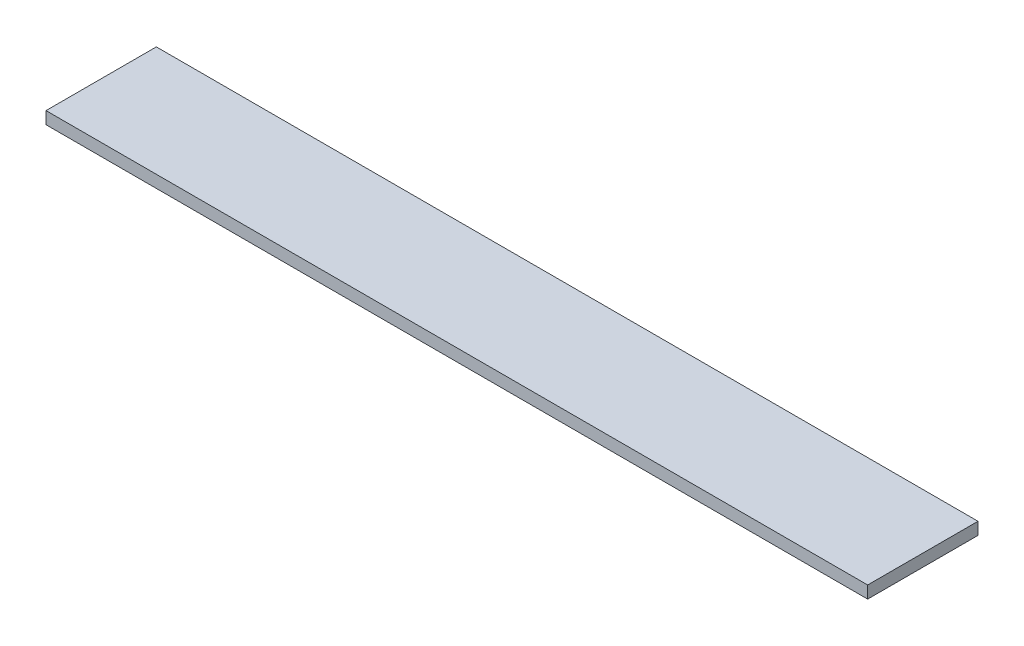
ISO-10303-21;
HEADER;
FILE_DESCRIPTION(('STEP AP214'),'2;1');
FILE_NAME('part.step','',(''),(''),'','','');
FILE_SCHEMA(('AUTOMOTIVE_DESIGN { 1 0 10303 214 1 1 1 1 }'));
ENDSEC;
DATA;
#1=APPLICATION_CONTEXT('core data for automotive mechanical design processes');
#2=APPLICATION_PROTOCOL_DEFINITION('international standard','automotive_design',2000,#1);
#3=PRODUCT_CONTEXT('',#1,'mechanical');
#4=PRODUCT('Part','Part','',(#3));
#5=PRODUCT_RELATED_PRODUCT_CATEGORY('part','',(#4));
#6=PRODUCT_DEFINITION_FORMATION('','',#4);
#7=PRODUCT_DEFINITION_CONTEXT('part definition',#1,'design');
#8=PRODUCT_DEFINITION('design','',#6,#7);
#9=PRODUCT_DEFINITION_SHAPE('','',#8);
#10=(LENGTH_UNIT() NAMED_UNIT(*) SI_UNIT(.MILLI.,.METRE.));
#11=(NAMED_UNIT(*) PLANE_ANGLE_UNIT() SI_UNIT($,.RADIAN.));
#12=(NAMED_UNIT(*) SI_UNIT($,.STERADIAN.) SOLID_ANGLE_UNIT());
#13=UNCERTAINTY_MEASURE_WITH_UNIT(LENGTH_MEASURE(1.E-05),#10,'distance_accuracy_value','');
#14=(GEOMETRIC_REPRESENTATION_CONTEXT(3) GLOBAL_UNCERTAINTY_ASSIGNED_CONTEXT((#13)) GLOBAL_UNIT_ASSIGNED_CONTEXT((#10,
#11,#12)) REPRESENTATION_CONTEXT('',''));
#15=CARTESIAN_POINT('',(0.,0.,0.));
#16=DIRECTION('',(0.,0.,1.));
#17=DIRECTION('',(1.,0.,0.));
#18=AXIS2_PLACEMENT_3D('',#15,#16,#17);
#19=CARTESIAN_POINT('',(100.53,-3.,-13.5));
#20=DIRECTION('',(1.,0.,0.));
#21=DIRECTION('',(0.,0.,-1.));
#22=AXIS2_PLACEMENT_3D('',#19,#20,#21);
#23=PLANE('',#22);
#24=DIRECTION('',(0.,0.,-1.));
#25=VECTOR('',#24,1.);
#26=CARTESIAN_POINT('',(100.53,0.,-13.5));
#27=LINE('',#26,#25);
#28=CARTESIAN_POINT('',(100.53,0.,13.5));
#29=VERTEX_POINT('',#28);
#30=CARTESIAN_POINT('',(100.53,0.,-13.5));
#31=VERTEX_POINT('',#30);
#32=EDGE_CURVE('E97',#29,#31,#27,.T.);
#33=ORIENTED_EDGE('',*,*,#32,.F.);
#34=DIRECTION('',(0.,1.,0.));
#35=VECTOR('',#34,1.);
#36=CARTESIAN_POINT('',(100.53,-3.,13.5));
#37=LINE('',#36,#35);
#38=CARTESIAN_POINT('',(100.53,-3.,13.5));
#39=VERTEX_POINT('',#38);
#40=EDGE_CURVE('E11',#39,#29,#37,.T.);
#41=ORIENTED_EDGE('',*,*,#40,.F.);
#42=DIRECTION('',(0.,0.,-1.));
#43=VECTOR('',#42,1.);
#44=CARTESIAN_POINT('',(100.53,-3.,-13.5));
#45=LINE('',#44,#43);
#46=CARTESIAN_POINT('',(100.53,-3.,-13.5));
#47=VERTEX_POINT('',#46);
#48=EDGE_CURVE('E91',#39,#47,#45,.T.);
#49=ORIENTED_EDGE('',*,*,#48,.T.);
#50=DIRECTION('',(0.,1.,0.));
#51=VECTOR('',#50,1.);
#52=CARTESIAN_POINT('',(100.53,-3.,-13.5));
#53=LINE('',#52,#51);
#54=EDGE_CURVE('E36',#47,#31,#53,.T.);
#55=ORIENTED_EDGE('',*,*,#54,.T.);
#56=EDGE_LOOP('',(#33,#41,#49,#55));
#57=FACE_BOUND('',#56,.T.);
#58=ADVANCED_FACE('F33',(#57),#23,.T.);
#59=CARTESIAN_POINT('',(-100.53,-3.,13.5));
#60=DIRECTION('',(0.,0.,1.));
#61=DIRECTION('',(1.,0.,0.));
#62=AXIS2_PLACEMENT_3D('',#59,#60,#61);
#63=PLANE('',#62);
#64=DIRECTION('',(1.,0.,0.));
#65=VECTOR('',#64,1.);
#66=CARTESIAN_POINT('',(-100.53,0.,13.5));
#67=LINE('',#66,#65);
#68=CARTESIAN_POINT('',(-100.53,0.,13.5));
#69=VERTEX_POINT('',#68);
#70=EDGE_CURVE('E93',#69,#29,#67,.T.);
#71=ORIENTED_EDGE('',*,*,#70,.F.);
#72=DIRECTION('',(0.,1.,0.));
#73=VECTOR('',#72,1.);
#74=CARTESIAN_POINT('',(-100.53,-3.,13.5));
#75=LINE('',#74,#73);
#76=CARTESIAN_POINT('',(-100.53,-3.,13.5));
#77=VERTEX_POINT('',#76);
#78=EDGE_CURVE('E42',#77,#69,#75,.T.);
#79=ORIENTED_EDGE('',*,*,#78,.F.);
#80=DIRECTION('',(1.,0.,0.));
#81=VECTOR('',#80,1.);
#82=CARTESIAN_POINT('',(-100.53,-3.,13.5));
#83=LINE('',#82,#81);
#84=EDGE_CURVE('E88',#77,#39,#83,.T.);
#85=ORIENTED_EDGE('',*,*,#84,.T.);
#86=ORIENTED_EDGE('',*,*,#40,.T.);
#87=EDGE_LOOP('',(#71,#79,#85,#86));
#88=FACE_BOUND('',#87,.T.);
#89=ADVANCED_FACE('F107',(#88),#63,.T.);
#90=CARTESIAN_POINT('',(-100.53,-3.,-13.5));
#91=DIRECTION('',(-1.,0.,0.));
#92=DIRECTION('',(0.,0.,1.));
#93=AXIS2_PLACEMENT_3D('',#90,#91,#92);
#94=PLANE('',#93);
#95=DIRECTION('',(0.,0.,1.));
#96=VECTOR('',#95,1.);
#97=CARTESIAN_POINT('',(-100.53,0.,-13.5));
#98=LINE('',#97,#96);
#99=CARTESIAN_POINT('',(-100.53,0.,-13.5));
#100=VERTEX_POINT('',#99);
#101=EDGE_CURVE('E83',#100,#69,#98,.T.);
#102=ORIENTED_EDGE('',*,*,#101,.F.);
#103=DIRECTION('',(0.,1.,0.));
#104=VECTOR('',#103,1.);
#105=CARTESIAN_POINT('',(-100.53,-3.,-13.5));
#106=LINE('',#105,#104);
#107=CARTESIAN_POINT('',(-100.53,-3.,-13.5));
#108=VERTEX_POINT('',#107);
#109=EDGE_CURVE('E78',#108,#100,#106,.T.);
#110=ORIENTED_EDGE('',*,*,#109,.F.);
#111=DIRECTION('',(0.,0.,1.));
#112=VECTOR('',#111,1.);
#113=CARTESIAN_POINT('',(-100.53,-3.,-13.5));
#114=LINE('',#113,#112);
#115=EDGE_CURVE('E81',#108,#77,#114,.T.);
#116=ORIENTED_EDGE('',*,*,#115,.T.);
#117=ORIENTED_EDGE('',*,*,#78,.T.);
#118=EDGE_LOOP('',(#102,#110,#116,#117));
#119=FACE_BOUND('',#118,.T.);
#120=ADVANCED_FACE('F80',(#119),#94,.T.);
#121=CARTESIAN_POINT('',(-100.53,-3.,-13.5));
#122=DIRECTION('',(0.,0.,-1.));
#123=DIRECTION('',(-1.,0.,0.));
#124=AXIS2_PLACEMENT_3D('',#121,#122,#123);
#125=PLANE('',#124);
#126=DIRECTION('',(-1.,0.,0.));
#127=VECTOR('',#126,1.);
#128=CARTESIAN_POINT('',(-100.53,0.,-13.5));
#129=LINE('',#128,#127);
#130=EDGE_CURVE('E100',#31,#100,#129,.T.);
#131=ORIENTED_EDGE('',*,*,#130,.F.);
#132=ORIENTED_EDGE('',*,*,#54,.F.);
#133=DIRECTION('',(-1.,0.,0.));
#134=VECTOR('',#133,1.);
#135=CARTESIAN_POINT('',(-100.53,-3.,-13.5));
#136=LINE('',#135,#134);
#137=EDGE_CURVE('E87',#47,#108,#136,.T.);
#138=ORIENTED_EDGE('',*,*,#137,.T.);
#139=ORIENTED_EDGE('',*,*,#109,.T.);
#140=EDGE_LOOP('',(#131,#132,#138,#139));
#141=FACE_BOUND('',#140,.T.);
#142=ADVANCED_FACE('F90',(#141),#125,.T.);
#143=CARTESIAN_POINT('',(0.,-3.,0.));
#144=DIRECTION('',(0.,1.,0.));
#145=DIRECTION('',(0.,0.,1.));
#146=AXIS2_PLACEMENT_3D('',#143,#144,#145);
#147=PLANE('',#146);
#148=ORIENTED_EDGE('',*,*,#48,.F.);
#149=ORIENTED_EDGE('',*,*,#84,.F.);
#150=ORIENTED_EDGE('',*,*,#115,.F.);
#151=ORIENTED_EDGE('',*,*,#137,.F.);
#152=EDGE_LOOP('',(#148,#149,#150,#151));
#153=FACE_BOUND('',#152,.T.);
#154=ADVANCED_FACE('F86',(#153),#147,.F.);
#155=CARTESIAN_POINT('',(0.,0.,0.));
#156=DIRECTION('',(0.,1.,0.));
#157=DIRECTION('',(0.,0.,1.));
#158=AXIS2_PLACEMENT_3D('',#155,#156,#157);
#159=PLANE('',#158);
#160=ORIENTED_EDGE('',*,*,#32,.T.);
#161=ORIENTED_EDGE('',*,*,#130,.T.);
#162=ORIENTED_EDGE('',*,*,#101,.T.);
#163=ORIENTED_EDGE('',*,*,#70,.T.);
#164=EDGE_LOOP('',(#160,#161,#162,#163));
#165=FACE_BOUND('',#164,.T.);
#166=ADVANCED_FACE('F106',(#165),#159,.T.);
#167=CLOSED_SHELL('',(#58,#89,#120,#142,#154,#166));
#168=MANIFOLD_SOLID_BREP('B2',#167);
#169=ADVANCED_BREP_SHAPE_REPRESENTATION('',(#18,#168),#14);
#170=SHAPE_DEFINITION_REPRESENTATION(#9,#169);
ENDSEC;
END-ISO-10303-21;
